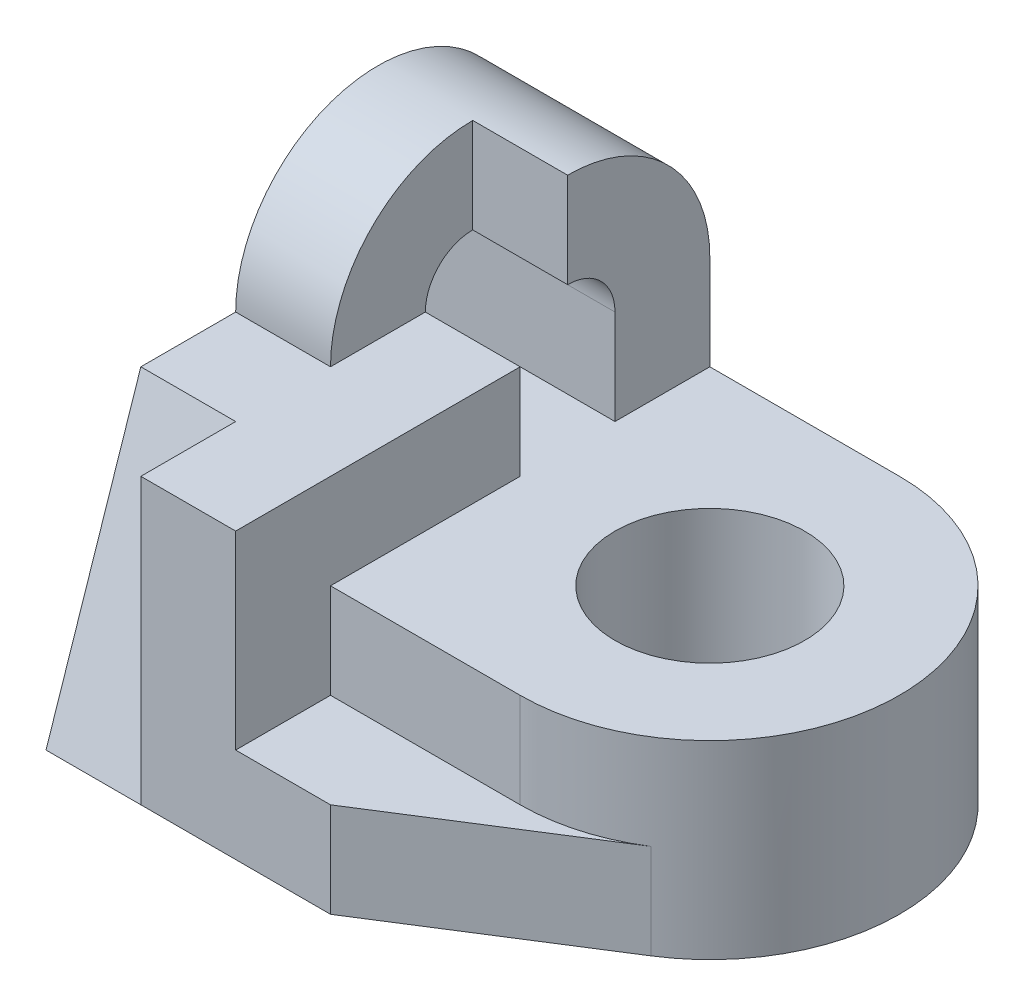
ISO-10303-21;
HEADER;
FILE_DESCRIPTION(('STEP AP214'),'2;1');
FILE_NAME('part.step','',(''),(''),'','','');
FILE_SCHEMA(('AUTOMOTIVE_DESIGN { 1 0 10303 214 1 1 1 1 }'));
ENDSEC;
DATA;
#1=APPLICATION_CONTEXT('core data for automotive mechanical design processes');
#2=APPLICATION_PROTOCOL_DEFINITION('international standard','automotive_design',2000,#1);
#3=PRODUCT_CONTEXT('',#1,'mechanical');
#4=PRODUCT('Part','Part','',(#3));
#5=PRODUCT_RELATED_PRODUCT_CATEGORY('part','',(#4));
#6=PRODUCT_DEFINITION_FORMATION('','',#4);
#7=PRODUCT_DEFINITION_CONTEXT('part definition',#1,'design');
#8=PRODUCT_DEFINITION('design','',#6,#7);
#9=PRODUCT_DEFINITION_SHAPE('','',#8);
#10=(LENGTH_UNIT() NAMED_UNIT(*) SI_UNIT(.MILLI.,.METRE.));
#11=(NAMED_UNIT(*) PLANE_ANGLE_UNIT() SI_UNIT($,.RADIAN.));
#12=(NAMED_UNIT(*) SI_UNIT($,.STERADIAN.) SOLID_ANGLE_UNIT());
#13=UNCERTAINTY_MEASURE_WITH_UNIT(LENGTH_MEASURE(1.E-05),#10,'distance_accuracy_value','');
#14=(GEOMETRIC_REPRESENTATION_CONTEXT(3) GLOBAL_UNCERTAINTY_ASSIGNED_CONTEXT((#13)) GLOBAL_UNIT_ASSIGNED_CONTEXT((#10,
#11,#12)) REPRESENTATION_CONTEXT('',''));
#15=CARTESIAN_POINT('',(0.,0.,0.));
#16=DIRECTION('',(0.,0.,1.));
#17=DIRECTION('',(1.,0.,0.));
#18=AXIS2_PLACEMENT_3D('',#15,#16,#17);
#19=CARTESIAN_POINT('',(-1.,0.,0.));
#20=DIRECTION('',(-1.,0.,0.));
#21=DIRECTION('',(0.,0.,1.));
#22=AXIS2_PLACEMENT_3D('',#19,#20,#21);
#23=PLANE('',#22);
#24=DIRECTION('',(0.,0.,1.));
#25=VECTOR('',#24,1.);
#26=CARTESIAN_POINT('',(-1.,2.,5.));
#27=LINE('',#26,#25);
#28=CARTESIAN_POINT('',(-1.,2.,4.));
#29=VERTEX_POINT('',#28);
#30=CARTESIAN_POINT('',(-1.,2.,5.));
#31=VERTEX_POINT('',#30);
#32=EDGE_CURVE('E317',#29,#31,#27,.T.);
#33=ORIENTED_EDGE('',*,*,#32,.F.);
#34=DIRECTION('',(0.,0.948683298050514,-0.316227766016838));
#35=VECTOR('',#34,1.);
#36=CARTESIAN_POINT('',(-1.,2.,4.));
#37=LINE('',#36,#35);
#38=CARTESIAN_POINT('',(-1.,-1.,5.));
#39=VERTEX_POINT('',#38);
#40=EDGE_CURVE('E48',#39,#29,#37,.T.);
#41=ORIENTED_EDGE('',*,*,#40,.F.);
#42=DIRECTION('',(0.,1.,0.));
#43=VECTOR('',#42,1.);
#44=CARTESIAN_POINT('',(-1.,-1.,5.));
#45=LINE('',#44,#43);
#46=EDGE_CURVE('E288',#39,#31,#45,.T.);
#47=ORIENTED_EDGE('',*,*,#46,.T.);
#48=EDGE_LOOP('',(#33,#41,#47));
#49=FACE_BOUND('',#48,.T.);
#50=ADVANCED_FACE('F33',(#49),#23,.T.);
#51=CARTESIAN_POINT('',(2.,1.,4.));
#52=DIRECTION('',(0.,-1.,0.));
#53=DIRECTION('',(1.,0.,0.));
#54=AXIS2_PLACEMENT_3D('',#51,#52,#53);
#55=PLANE('',#54);
#56=CARTESIAN_POINT('',(2.,1.,2.));
#57=DIRECTION('',(0.,1.,0.));
#58=DIRECTION('',(-1.,0.,0.));
#59=AXIS2_PLACEMENT_3D('',#56,#57,#58);
#60=CIRCLE('',#59,1.);
#61=CARTESIAN_POINT('',(1.,1.,2.));
#62=VERTEX_POINT('',#61);
#63=EDGE_CURVE('E196',#62,#62,#60,.T.);
#64=ORIENTED_EDGE('',*,*,#63,.F.);
#65=EDGE_LOOP('',(#64));
#66=FACE_BOUND('',#65,.T.);
#67=DIRECTION('',(0.,0.,1.));
#68=VECTOR('',#67,1.);
#69=CARTESIAN_POINT('',(0.,1.,3.));
#70=LINE('',#69,#68);
#71=CARTESIAN_POINT('',(0.,1.,2.));
#72=VERTEX_POINT('',#71);
#73=CARTESIAN_POINT('',(0.,1.,4.));
#74=VERTEX_POINT('',#73);
#75=EDGE_CURVE('E255',#72,#74,#70,.T.);
#76=ORIENTED_EDGE('',*,*,#75,.T.);
#77=DIRECTION('',(-1.,0.,0.));
#78=VECTOR('',#77,1.);
#79=CARTESIAN_POINT('',(2.,1.,4.));
#80=LINE('',#79,#78);
#81=CARTESIAN_POINT('',(2.,1.,4.));
#82=VERTEX_POINT('',#81);
#83=EDGE_CURVE('E221',#82,#74,#80,.T.);
#84=ORIENTED_EDGE('',*,*,#83,.F.);
#85=CARTESIAN_POINT('',(2.,1.,2.));
#86=DIRECTION('',(0.,1.,0.));
#87=DIRECTION('',(1.,0.,0.));
#88=AXIS2_PLACEMENT_3D('',#85,#86,#87);
#89=CIRCLE('',#88,2.);
#90=CARTESIAN_POINT('',(2.,1.,0.));
#91=VERTEX_POINT('',#90);
#92=EDGE_CURVE('E211',#82,#91,#89,.T.);
#93=ORIENTED_EDGE('',*,*,#92,.T.);
#94=DIRECTION('',(-1.,0.,0.));
#95=VECTOR('',#94,1.);
#96=CARTESIAN_POINT('',(2.,1.,0.));
#97=LINE('',#96,#95);
#98=CARTESIAN_POINT('',(0.,1.,0.));
#99=VERTEX_POINT('',#98);
#100=EDGE_CURVE('E222',#91,#99,#97,.T.);
#101=ORIENTED_EDGE('',*,*,#100,.T.);
#102=DIRECTION('',(0.,0.,1.));
#103=VECTOR('',#102,1.);
#104=CARTESIAN_POINT('',(0.,1.,1.));
#105=LINE('',#104,#103);
#106=CARTESIAN_POINT('',(0.,1.,1.));
#107=VERTEX_POINT('',#106);
#108=EDGE_CURVE('E187',#99,#107,#105,.T.);
#109=ORIENTED_EDGE('',*,*,#108,.T.);
#110=DIRECTION('',(-1.,0.,0.));
#111=VECTOR('',#110,1.);
#112=CARTESIAN_POINT('',(0.,1.,1.));
#113=LINE('',#112,#111);
#114=CARTESIAN_POINT('',(-2.,1.,1.));
#115=VERTEX_POINT('',#114);
#116=EDGE_CURVE('E205',#107,#115,#113,.T.);
#117=ORIENTED_EDGE('',*,*,#116,.T.);
#118=DIRECTION('',(0.,0.,-1.));
#119=VECTOR('',#118,1.);
#120=CARTESIAN_POINT('',(-2.,1.,4.));
#121=LINE('',#120,#119);
#122=CARTESIAN_POINT('',(-2.,1.,2.));
#123=VERTEX_POINT('',#122);
#124=EDGE_CURVE('E41',#123,#115,#121,.T.);
#125=ORIENTED_EDGE('',*,*,#124,.F.);
#126=DIRECTION('',(-1.,0.,0.));
#127=VECTOR('',#126,1.);
#128=CARTESIAN_POINT('',(0.,1.,2.));
#129=LINE('',#128,#127);
#130=EDGE_CURVE('E170',#72,#123,#129,.T.);
#131=ORIENTED_EDGE('',*,*,#130,.F.);
#132=EDGE_LOOP('',(#76,#84,#93,#101,#109,#117,#125,#131));
#133=FACE_BOUND('',#132,.T.);
#134=ADVANCED_FACE('F354',(#66,#133),#55,.F.);
#135=CARTESIAN_POINT('',(0.,0.,4.));
#136=DIRECTION('',(0.,0.,1.));
#137=DIRECTION('',(1.,0.,0.));
#138=AXIS2_PLACEMENT_3D('',#135,#136,#137);
#139=PLANE('',#138);
#140=DIRECTION('',(0.,-1.,0.));
#141=VECTOR('',#140,1.);
#142=CARTESIAN_POINT('',(0.,-1.,4.));
#143=LINE('',#142,#141);
#144=CARTESIAN_POINT('',(0.,0.,4.));
#145=VERTEX_POINT('',#144);
#146=EDGE_CURVE('E283',#74,#145,#143,.T.);
#147=ORIENTED_EDGE('',*,*,#146,.T.);
#148=DIRECTION('',(1.,0.,0.));
#149=VECTOR('',#148,1.);
#150=CARTESIAN_POINT('',(0.,0.,4.));
#151=LINE('',#150,#149);
#152=CARTESIAN_POINT('',(2.,0.,4.));
#153=VERTEX_POINT('',#152);
#154=EDGE_CURVE('E310',#145,#153,#151,.T.);
#155=ORIENTED_EDGE('',*,*,#154,.T.);
#156=DIRECTION('',(0.,1.,0.));
#157=VECTOR('',#156,1.);
#158=CARTESIAN_POINT('',(2.,-1.,4.));
#159=LINE('',#158,#157);
#160=EDGE_CURVE('E219',#153,#82,#159,.T.);
#161=ORIENTED_EDGE('',*,*,#160,.T.);
#162=ORIENTED_EDGE('',*,*,#83,.T.);
#163=EDGE_LOOP('',(#147,#155,#161,#162));
#164=FACE_BOUND('',#163,.T.);
#165=ADVANCED_FACE('F359',(#164),#139,.T.);
#166=CARTESIAN_POINT('',(2.,-1.,2.));
#167=DIRECTION('',(0.,1.,0.));
#168=DIRECTION('',(-1.,0.,0.));
#169=AXIS2_PLACEMENT_3D('',#166,#167,#168);
#170=CYLINDRICAL_SURFACE('',#169,2.);
#171=CARTESIAN_POINT('',(2.,0.,2.));
#172=DIRECTION('',(0.,1.,0.));
#173=DIRECTION('',(1.,0.,0.));
#174=AXIS2_PLACEMENT_3D('',#171,#172,#173);
#175=CIRCLE('',#174,2.);
#176=CARTESIAN_POINT('',(3.06969384566991,0.,3.68989794855664));
#177=VERTEX_POINT('',#176);
#178=EDGE_CURVE('E307',#153,#177,#175,.T.);
#179=ORIENTED_EDGE('',*,*,#178,.T.);
#180=DIRECTION('',(0.,-1.,0.));
#181=VECTOR('',#180,1.);
#182=CARTESIAN_POINT('',(3.06969384566991,0.,3.68989794855664));
#183=LINE('',#182,#181);
#184=CARTESIAN_POINT('',(3.06969384566991,-1.,3.68989794855664));
#185=VERTEX_POINT('',#184);
#186=EDGE_CURVE('E291',#177,#185,#183,.T.);
#187=ORIENTED_EDGE('',*,*,#186,.T.);
#188=CARTESIAN_POINT('',(2.,-1.,2.));
#189=DIRECTION('',(0.,1.,0.));
#190=DIRECTION('',(1.,0.,0.));
#191=AXIS2_PLACEMENT_3D('',#188,#189,#190);
#192=CIRCLE('',#191,2.);
#193=CARTESIAN_POINT('',(2.,-1.,0.));
#194=VERTEX_POINT('',#193);
#195=EDGE_CURVE('E214',#185,#194,#192,.T.);
#196=ORIENTED_EDGE('',*,*,#195,.T.);
#197=DIRECTION('',(0.,1.,0.));
#198=VECTOR('',#197,1.);
#199=CARTESIAN_POINT('',(2.,-1.,0.));
#200=LINE('',#199,#198);
#201=EDGE_CURVE('E229',#194,#91,#200,.T.);
#202=ORIENTED_EDGE('',*,*,#201,.T.);
#203=ORIENTED_EDGE('',*,*,#92,.F.);
#204=ORIENTED_EDGE('',*,*,#160,.F.);
#205=EDGE_LOOP('',(#179,#187,#196,#202,#203,#204));
#206=FACE_BOUND('',#205,.T.);
#207=ADVANCED_FACE('F334',(#206),#170,.T.);
#208=CARTESIAN_POINT('',(0.,1.,5.));
#209=DIRECTION('',(0.,0.,1.));
#210=DIRECTION('',(1.,0.,0.));
#211=AXIS2_PLACEMENT_3D('',#208,#209,#210);
#212=PLANE('',#211);
#213=DIRECTION('',(0.,1.,0.));
#214=VECTOR('',#213,1.);
#215=CARTESIAN_POINT('',(0.,1.,5.));
#216=LINE('',#215,#214);
#217=CARTESIAN_POINT('',(0.,0.,5.));
#218=VERTEX_POINT('',#217);
#219=CARTESIAN_POINT('',(0.,2.,5.));
#220=VERTEX_POINT('',#219);
#221=EDGE_CURVE('E281',#218,#220,#216,.T.);
#222=ORIENTED_EDGE('',*,*,#221,.T.);
#223=DIRECTION('',(1.,0.,0.));
#224=VECTOR('',#223,1.);
#225=CARTESIAN_POINT('',(0.,2.,5.));
#226=LINE('',#225,#224);
#227=EDGE_CURVE('E301',#31,#220,#226,.T.);
#228=ORIENTED_EDGE('',*,*,#227,.F.);
#229=ORIENTED_EDGE('',*,*,#46,.F.);
#230=DIRECTION('',(-1.,0.,0.));
#231=VECTOR('',#230,1.);
#232=CARTESIAN_POINT('',(0.,-1.,5.));
#233=LINE('',#232,#231);
#234=CARTESIAN_POINT('',(1.,-1.,5.));
#235=VERTEX_POINT('',#234);
#236=EDGE_CURVE('E270',#235,#39,#233,.T.);
#237=ORIENTED_EDGE('',*,*,#236,.F.);
#238=DIRECTION('',(0.,-1.,0.));
#239=VECTOR('',#238,1.);
#240=CARTESIAN_POINT('',(1.,0.,5.));
#241=LINE('',#240,#239);
#242=CARTESIAN_POINT('',(1.,0.,5.));
#243=VERTEX_POINT('',#242);
#244=EDGE_CURVE('E290',#243,#235,#241,.T.);
#245=ORIENTED_EDGE('',*,*,#244,.F.);
#246=DIRECTION('',(-1.,0.,0.));
#247=VECTOR('',#246,1.);
#248=CARTESIAN_POINT('',(0.,0.,5.));
#249=LINE('',#248,#247);
#250=EDGE_CURVE('E294',#243,#218,#249,.T.);
#251=ORIENTED_EDGE('',*,*,#250,.T.);
#252=EDGE_LOOP('',(#222,#228,#229,#237,#245,#251));
#253=FACE_BOUND('',#252,.T.);
#254=ADVANCED_FACE('F345',(#253),#212,.T.);
#255=CARTESIAN_POINT('',(0.,2.,1.5));
#256=DIRECTION('',(1.,0.,0.));
#257=DIRECTION('',(0.,0.,-1.));
#258=AXIS2_PLACEMENT_3D('',#255,#256,#257);
#259=PLANE('',#258);
#260=DIRECTION('',(0.,0.,-1.));
#261=VECTOR('',#260,1.);
#262=CARTESIAN_POINT('',(0.,2.,2.));
#263=LINE('',#262,#261);
#264=CARTESIAN_POINT('',(0.,2.,2.));
#265=VERTEX_POINT('',#264);
#266=EDGE_CURVE('E265',#220,#265,#263,.T.);
#267=ORIENTED_EDGE('',*,*,#266,.F.);
#268=ORIENTED_EDGE('',*,*,#221,.F.);
#269=DIRECTION('',(0.,0.,-1.));
#270=VECTOR('',#269,1.);
#271=CARTESIAN_POINT('',(0.,0.,5.));
#272=LINE('',#271,#270);
#273=EDGE_CURVE('E300',#218,#145,#272,.T.);
#274=ORIENTED_EDGE('',*,*,#273,.T.);
#275=ORIENTED_EDGE('',*,*,#146,.F.);
#276=ORIENTED_EDGE('',*,*,#75,.F.);
#277=DIRECTION('',(0.,-1.,0.));
#278=VECTOR('',#277,1.);
#279=CARTESIAN_POINT('',(0.,1.,2.));
#280=LINE('',#279,#278);
#281=EDGE_CURVE('E257',#265,#72,#280,.T.);
#282=ORIENTED_EDGE('',*,*,#281,.F.);
#283=EDGE_LOOP('',(#267,#268,#274,#275,#276,#282));
#284=FACE_BOUND('',#283,.T.);
#285=ADVANCED_FACE('F349',(#284),#259,.T.);
#286=CARTESIAN_POINT('',(-2.,-1.,4.));
#287=DIRECTION('',(1.,0.,0.));
#288=DIRECTION('',(0.,0.,-1.));
#289=AXIS2_PLACEMENT_3D('',#286,#287,#288);
#290=PLANE('',#289);
#291=DIRECTION('',(0.,0.,-1.));
#292=VECTOR('',#291,1.);
#293=CARTESIAN_POINT('',(-2.,-1.,4.));
#294=LINE('',#293,#292);
#295=CARTESIAN_POINT('',(-2.,-1.,5.));
#296=VERTEX_POINT('',#295);
#297=CARTESIAN_POINT('',(-2.,-1.,0.));
#298=VERTEX_POINT('',#297);
#299=EDGE_CURVE('E11',#296,#298,#294,.T.);
#300=ORIENTED_EDGE('',*,*,#299,.F.);
#301=DIRECTION('',(0.,0.948683298050514,-0.316227766016838));
#302=VECTOR('',#301,1.);
#303=CARTESIAN_POINT('',(-2.,2.,4.));
#304=LINE('',#303,#302);
#305=CARTESIAN_POINT('',(-2.,2.,4.));
#306=VERTEX_POINT('',#305);
#307=EDGE_CURVE('E179',#296,#306,#304,.T.);
#308=ORIENTED_EDGE('',*,*,#307,.T.);
#309=DIRECTION('',(0.,0.,1.));
#310=VECTOR('',#309,1.);
#311=CARTESIAN_POINT('',(-2.,2.,4.));
#312=LINE('',#311,#310);
#313=CARTESIAN_POINT('',(-2.,2.,3.));
#314=VERTEX_POINT('',#313);
#315=EDGE_CURVE('E162',#314,#306,#312,.T.);
#316=ORIENTED_EDGE('',*,*,#315,.F.);
#317=CARTESIAN_POINT('',(-2.,2.,1.5));
#318=DIRECTION('',(-1.,0.,0.));
#319=DIRECTION('',(0.,0.,-1.));
#320=AXIS2_PLACEMENT_3D('',#317,#318,#319);
#321=CIRCLE('',#320,1.5);
#322=CARTESIAN_POINT('',(-2.,2.,0.));
#323=VERTEX_POINT('',#322);
#324=EDGE_CURVE('E177',#314,#323,#321,.T.);
#325=ORIENTED_EDGE('',*,*,#324,.T.);
#326=DIRECTION('',(0.,-1.,0.));
#327=VECTOR('',#326,1.);
#328=CARTESIAN_POINT('',(-2.,-1.,0.));
#329=LINE('',#328,#327);
#330=EDGE_CURVE('E216',#323,#298,#329,.T.);
#331=ORIENTED_EDGE('',*,*,#330,.T.);
#332=EDGE_LOOP('',(#300,#308,#316,#325,#331));
#333=FACE_BOUND('',#332,.T.);
#334=ORIENTED_EDGE('',*,*,#124,.T.);
#335=DIRECTION('',(0.,1.,0.));
#336=VECTOR('',#335,1.);
#337=CARTESIAN_POINT('',(-2.,1.,1.));
#338=LINE('',#337,#336);
#339=CARTESIAN_POINT('',(-2.,2.,1.));
#340=VERTEX_POINT('',#339);
#341=EDGE_CURVE('E237',#115,#340,#338,.T.);
#342=ORIENTED_EDGE('',*,*,#341,.T.);
#343=CARTESIAN_POINT('',(-2.,2.,1.5));
#344=DIRECTION('',(1.,0.,0.));
#345=DIRECTION('',(0.,0.,-1.));
#346=AXIS2_PLACEMENT_3D('',#343,#344,#345);
#347=CIRCLE('',#346,0.5);
#348=CARTESIAN_POINT('',(-2.,2.,2.));
#349=VERTEX_POINT('',#348);
#350=EDGE_CURVE('E192',#340,#349,#347,.T.);
#351=ORIENTED_EDGE('',*,*,#350,.T.);
#352=DIRECTION('',(0.,-1.,0.));
#353=VECTOR('',#352,1.);
#354=CARTESIAN_POINT('',(-2.,1.,2.));
#355=LINE('',#354,#353);
#356=EDGE_CURVE('E188',#349,#123,#355,.T.);
#357=ORIENTED_EDGE('',*,*,#356,.T.);
#358=EDGE_LOOP('',(#334,#342,#351,#357));
#359=FACE_BOUND('',#358,.T.);
#360=ADVANCED_FACE('F35',(#333,#359),#290,.F.);
#361=CARTESIAN_POINT('',(2.,-1.,4.));
#362=DIRECTION('',(0.,1.,0.));
#363=DIRECTION('',(-1.,0.,0.));
#364=AXIS2_PLACEMENT_3D('',#361,#362,#363);
#365=PLANE('',#364);
#366=ORIENTED_EDGE('',*,*,#195,.F.);
#367=DIRECTION('',(-0.844948974278318,0.,0.534846922834954));
#368=VECTOR('',#367,1.);
#369=CARTESIAN_POINT('',(1.,-1.,5.));
#370=LINE('',#369,#368);
#371=EDGE_CURVE('E297',#185,#235,#370,.T.);
#372=ORIENTED_EDGE('',*,*,#371,.T.);
#373=ORIENTED_EDGE('',*,*,#236,.T.);
#374=DIRECTION('',(-1.,0.,0.));
#375=VECTOR('',#374,1.);
#376=CARTESIAN_POINT('',(-1.,-1.,5.));
#377=LINE('',#376,#375);
#378=EDGE_CURVE('E286',#39,#296,#377,.T.);
#379=ORIENTED_EDGE('',*,*,#378,.T.);
#380=ORIENTED_EDGE('',*,*,#299,.T.);
#381=DIRECTION('',(1.,0.,0.));
#382=VECTOR('',#381,1.);
#383=CARTESIAN_POINT('',(2.,-1.,0.));
#384=LINE('',#383,#382);
#385=EDGE_CURVE('E226',#298,#194,#384,.T.);
#386=ORIENTED_EDGE('',*,*,#385,.T.);
#387=EDGE_LOOP('',(#366,#372,#373,#379,#380,#386));
#388=FACE_BOUND('',#387,.T.);
#389=CARTESIAN_POINT('',(2.,-1.,2.));
#390=DIRECTION('',(0.,1.,0.));
#391=DIRECTION('',(-1.,0.,0.));
#392=AXIS2_PLACEMENT_3D('',#389,#390,#391);
#393=CIRCLE('',#392,1.);
#394=CARTESIAN_POINT('',(1.,-1.,2.));
#395=VERTEX_POINT('',#394);
#396=EDGE_CURVE('E208',#395,#395,#393,.T.);
#397=ORIENTED_EDGE('',*,*,#396,.T.);
#398=EDGE_LOOP('',(#397));
#399=FACE_BOUND('',#398,.T.);
#400=ADVANCED_FACE('F327',(#388,#399),#365,.F.);
#401=CARTESIAN_POINT('',(0.,0.,0.));
#402=DIRECTION('',(0.,0.,1.));
#403=DIRECTION('',(1.,0.,0.));
#404=AXIS2_PLACEMENT_3D('',#401,#402,#403);
#405=PLANE('',#404);
#406=ORIENTED_EDGE('',*,*,#330,.F.);
#407=DIRECTION('',(-1.,0.,0.));
#408=VECTOR('',#407,1.);
#409=CARTESIAN_POINT('',(0.,2.,0.));
#410=LINE('',#409,#408);
#411=CARTESIAN_POINT('',(0.,2.,0.));
#412=VERTEX_POINT('',#411);
#413=EDGE_CURVE('E169',#412,#323,#410,.T.);
#414=ORIENTED_EDGE('',*,*,#413,.F.);
#415=DIRECTION('',(0.,-1.,0.));
#416=VECTOR('',#415,1.);
#417=CARTESIAN_POINT('',(0.,1.,0.));
#418=LINE('',#417,#416);
#419=EDGE_CURVE('E207',#412,#99,#418,.T.);
#420=ORIENTED_EDGE('',*,*,#419,.T.);
#421=ORIENTED_EDGE('',*,*,#100,.F.);
#422=ORIENTED_EDGE('',*,*,#201,.F.);
#423=ORIENTED_EDGE('',*,*,#385,.F.);
#424=EDGE_LOOP('',(#406,#414,#420,#421,#422,#423));
#425=FACE_BOUND('',#424,.T.);
#426=ADVANCED_FACE('F330',(#425),#405,.F.);
#427=CARTESIAN_POINT('',(2.,-1.,2.));
#428=DIRECTION('',(0.,1.,0.));
#429=DIRECTION('',(-1.,0.,0.));
#430=AXIS2_PLACEMENT_3D('',#427,#428,#429);
#431=CYLINDRICAL_SURFACE('',#430,1.);
#432=ORIENTED_EDGE('',*,*,#396,.F.);
#433=EDGE_LOOP('',(#432));
#434=FACE_BOUND('',#433,.T.);
#435=ORIENTED_EDGE('',*,*,#63,.T.);
#436=EDGE_LOOP('',(#435));
#437=FACE_BOUND('',#436,.T.);
#438=ADVANCED_FACE('F383',(#434,#437),#431,.F.);
#439=CARTESIAN_POINT('',(0.,2.,1.5));
#440=DIRECTION('',(-1.,0.,0.));
#441=DIRECTION('',(0.,0.,1.));
#442=AXIS2_PLACEMENT_3D('',#439,#440,#441);
#443=CYLINDRICAL_SURFACE('',#442,1.5);
#444=DIRECTION('',(1.,0.,0.));
#445=VECTOR('',#444,1.);
#446=CARTESIAN_POINT('',(-1.,3.5,1.5));
#447=LINE('',#446,#445);
#448=CARTESIAN_POINT('',(-1.,3.5,1.5));
#449=VERTEX_POINT('',#448);
#450=CARTESIAN_POINT('',(0.,3.5,1.5));
#451=VERTEX_POINT('',#450);
#452=EDGE_CURVE('E247',#449,#451,#447,.T.);
#453=ORIENTED_EDGE('',*,*,#452,.T.);
#454=CARTESIAN_POINT('',(0.,2.,1.5));
#455=DIRECTION('',(-1.,0.,0.));
#456=DIRECTION('',(0.,0.,-1.));
#457=AXIS2_PLACEMENT_3D('',#454,#455,#456);
#458=CIRCLE('',#457,1.5);
#459=EDGE_CURVE('E253',#451,#412,#458,.T.);
#460=ORIENTED_EDGE('',*,*,#459,.T.);
#461=ORIENTED_EDGE('',*,*,#413,.T.);
#462=ORIENTED_EDGE('',*,*,#324,.F.);
#463=DIRECTION('',(-1.,0.,0.));
#464=VECTOR('',#463,1.);
#465=CARTESIAN_POINT('',(0.,2.,3.));
#466=LINE('',#465,#464);
#467=CARTESIAN_POINT('',(-1.,2.,3.));
#468=VERTEX_POINT('',#467);
#469=EDGE_CURVE('E159',#468,#314,#466,.T.);
#470=ORIENTED_EDGE('',*,*,#469,.F.);
#471=CARTESIAN_POINT('',(-1.,2.,1.5));
#472=DIRECTION('',(1.,0.,0.));
#473=DIRECTION('',(0.,0.,1.));
#474=AXIS2_PLACEMENT_3D('',#471,#472,#473);
#475=CIRCLE('',#474,1.5);
#476=EDGE_CURVE('E272',#449,#468,#475,.T.);
#477=ORIENTED_EDGE('',*,*,#476,.F.);
#478=EDGE_LOOP('',(#453,#460,#461,#462,#470,#477));
#479=FACE_BOUND('',#478,.T.);
#480=ADVANCED_FACE('F185',(#479),#443,.T.);
#481=CARTESIAN_POINT('',(0.,1.,2.));
#482=DIRECTION('',(0.,0.,-1.));
#483=DIRECTION('',(-1.,0.,0.));
#484=AXIS2_PLACEMENT_3D('',#481,#482,#483);
#485=PLANE('',#484);
#486=ORIENTED_EDGE('',*,*,#356,.F.);
#487=DIRECTION('',(-1.,0.,0.));
#488=VECTOR('',#487,1.);
#489=CARTESIAN_POINT('',(0.,2.,2.));
#490=LINE('',#489,#488);
#491=CARTESIAN_POINT('',(-1.,2.,2.));
#492=VERTEX_POINT('',#491);
#493=EDGE_CURVE('E202',#492,#349,#490,.T.);
#494=ORIENTED_EDGE('',*,*,#493,.F.);
#495=EDGE_CURVE('E200',#265,#492,#490,.T.);
#496=ORIENTED_EDGE('',*,*,#495,.F.);
#497=ORIENTED_EDGE('',*,*,#281,.T.);
#498=ORIENTED_EDGE('',*,*,#130,.T.);
#499=EDGE_LOOP('',(#486,#494,#496,#497,#498));
#500=FACE_BOUND('',#499,.T.);
#501=ADVANCED_FACE('F382',(#500),#485,.T.);
#502=CARTESIAN_POINT('',(0.,2.,1.5));
#503=DIRECTION('',(-1.,0.,0.));
#504=DIRECTION('',(0.,0.,1.));
#505=AXIS2_PLACEMENT_3D('',#502,#503,#504);
#506=CYLINDRICAL_SURFACE('',#505,0.5);
#507=DIRECTION('',(1.,0.,0.));
#508=VECTOR('',#507,1.);
#509=CARTESIAN_POINT('',(-1.,2.5,1.5));
#510=LINE('',#509,#508);
#511=CARTESIAN_POINT('',(-1.,2.5,1.5));
#512=VERTEX_POINT('',#511);
#513=CARTESIAN_POINT('',(0.,2.5,1.5));
#514=VERTEX_POINT('',#513);
#515=EDGE_CURVE('E56',#512,#514,#510,.T.);
#516=ORIENTED_EDGE('',*,*,#515,.F.);
#517=CARTESIAN_POINT('',(-1.,2.,1.5));
#518=DIRECTION('',(-1.,0.,0.));
#519=DIRECTION('',(0.,0.,-1.));
#520=AXIS2_PLACEMENT_3D('',#517,#518,#519);
#521=CIRCLE('',#520,0.5);
#522=EDGE_CURVE('E267',#492,#512,#521,.T.);
#523=ORIENTED_EDGE('',*,*,#522,.F.);
#524=ORIENTED_EDGE('',*,*,#493,.T.);
#525=ORIENTED_EDGE('',*,*,#350,.F.);
#526=DIRECTION('',(-1.,0.,0.));
#527=VECTOR('',#526,1.);
#528=CARTESIAN_POINT('',(0.,2.,1.));
#529=LINE('',#528,#527);
#530=CARTESIAN_POINT('',(0.,2.,1.));
#531=VERTEX_POINT('',#530);
#532=EDGE_CURVE('E203',#531,#340,#529,.T.);
#533=ORIENTED_EDGE('',*,*,#532,.F.);
#534=CARTESIAN_POINT('',(0.,2.,1.5));
#535=DIRECTION('',(1.,0.,0.));
#536=DIRECTION('',(0.,0.,-1.));
#537=AXIS2_PLACEMENT_3D('',#534,#535,#536);
#538=CIRCLE('',#537,0.5);
#539=EDGE_CURVE('E260',#531,#514,#538,.T.);
#540=ORIENTED_EDGE('',*,*,#539,.T.);
#541=EDGE_LOOP('',(#516,#523,#524,#525,#533,#540));
#542=FACE_BOUND('',#541,.T.);
#543=ADVANCED_FACE('F386',(#542),#506,.F.);
#544=CARTESIAN_POINT('',(0.,1.,1.));
#545=DIRECTION('',(0.,0.,1.));
#546=DIRECTION('',(1.,0.,0.));
#547=AXIS2_PLACEMENT_3D('',#544,#545,#546);
#548=PLANE('',#547);
#549=ORIENTED_EDGE('',*,*,#341,.F.);
#550=ORIENTED_EDGE('',*,*,#116,.F.);
#551=DIRECTION('',(0.,1.,0.));
#552=VECTOR('',#551,1.);
#553=CARTESIAN_POINT('',(0.,1.,1.));
#554=LINE('',#553,#552);
#555=EDGE_CURVE('E190',#107,#531,#554,.T.);
#556=ORIENTED_EDGE('',*,*,#555,.T.);
#557=ORIENTED_EDGE('',*,*,#532,.T.);
#558=EDGE_LOOP('',(#549,#550,#556,#557));
#559=FACE_BOUND('',#558,.T.);
#560=ADVANCED_FACE('F243',(#559),#548,.T.);
#561=DIRECTION('',(0.,1.,0.));
#562=VECTOR('',#561,1.);
#563=CARTESIAN_POINT('',(0.,2.5,1.5));
#564=LINE('',#563,#562);
#565=EDGE_CURVE('E268',#514,#451,#564,.T.);
#566=ORIENTED_EDGE('',*,*,#565,.F.);
#567=ORIENTED_EDGE('',*,*,#539,.F.);
#568=ORIENTED_EDGE('',*,*,#555,.F.);
#569=ORIENTED_EDGE('',*,*,#108,.F.);
#570=ORIENTED_EDGE('',*,*,#419,.F.);
#571=ORIENTED_EDGE('',*,*,#459,.F.);
#572=EDGE_LOOP('',(#566,#567,#568,#569,#570,#571));
#573=FACE_BOUND('',#572,.T.);
#574=ADVANCED_FACE('F374',(#573),#259,.T.);
#575=CARTESIAN_POINT('',(-1.,2.,2.));
#576=DIRECTION('',(0.,-1.,0.));
#577=DIRECTION('',(0.,0.,-1.));
#578=AXIS2_PLACEMENT_3D('',#575,#576,#577);
#579=PLANE('',#578);
#580=ORIENTED_EDGE('',*,*,#266,.T.);
#581=ORIENTED_EDGE('',*,*,#495,.T.);
#582=DIRECTION('',(0.,0.,-1.));
#583=VECTOR('',#582,1.);
#584=CARTESIAN_POINT('',(-1.,2.,2.));
#585=LINE('',#584,#583);
#586=EDGE_CURVE('E165',#468,#492,#585,.T.);
#587=ORIENTED_EDGE('',*,*,#586,.F.);
#588=ORIENTED_EDGE('',*,*,#469,.T.);
#589=ORIENTED_EDGE('',*,*,#315,.T.);
#590=DIRECTION('',(1.,0.,0.));
#591=VECTOR('',#590,1.);
#592=CARTESIAN_POINT('',(-1.,2.,4.));
#593=LINE('',#592,#591);
#594=EDGE_CURVE('E181',#306,#29,#593,.T.);
#595=ORIENTED_EDGE('',*,*,#594,.T.);
#596=ORIENTED_EDGE('',*,*,#32,.T.);
#597=ORIENTED_EDGE('',*,*,#227,.T.);
#598=EDGE_LOOP('',(#580,#581,#587,#588,#589,#595,#596,#597));
#599=FACE_BOUND('',#598,.T.);
#600=ADVANCED_FACE('F161',(#599),#579,.F.);
#601=CARTESIAN_POINT('',(-1.,2.5,1.5));
#602=DIRECTION('',(0.,0.,-1.));
#603=DIRECTION('',(-1.,0.,0.));
#604=AXIS2_PLACEMENT_3D('',#601,#602,#603);
#605=PLANE('',#604);
#606=ORIENTED_EDGE('',*,*,#565,.T.);
#607=ORIENTED_EDGE('',*,*,#452,.F.);
#608=DIRECTION('',(0.,1.,0.));
#609=VECTOR('',#608,1.);
#610=CARTESIAN_POINT('',(-1.,2.5,1.5));
#611=LINE('',#610,#609);
#612=EDGE_CURVE('E274',#512,#449,#611,.T.);
#613=ORIENTED_EDGE('',*,*,#612,.F.);
#614=ORIENTED_EDGE('',*,*,#515,.T.);
#615=EDGE_LOOP('',(#606,#607,#613,#614));
#616=FACE_BOUND('',#615,.T.);
#617=ADVANCED_FACE('F370',(#616),#605,.F.);
#618=CARTESIAN_POINT('',(-1.,2.,1.5));
#619=DIRECTION('',(1.,0.,0.));
#620=DIRECTION('',(0.,0.,-1.));
#621=AXIS2_PLACEMENT_3D('',#618,#619,#620);
#622=PLANE('',#621);
#623=ORIENTED_EDGE('',*,*,#522,.T.);
#624=ORIENTED_EDGE('',*,*,#612,.T.);
#625=ORIENTED_EDGE('',*,*,#476,.T.);
#626=ORIENTED_EDGE('',*,*,#586,.T.);
#627=EDGE_LOOP('',(#623,#624,#625,#626));
#628=FACE_BOUND('',#627,.T.);
#629=ADVANCED_FACE('F367',(#628),#622,.T.);
#630=CARTESIAN_POINT('',(1.,0.,5.));
#631=DIRECTION('',(0.534846922834954,0.,0.844948974278318));
#632=DIRECTION('',(0.844948974278318,0.,-0.534846922834954));
#633=AXIS2_PLACEMENT_3D('',#630,#631,#632);
#634=PLANE('',#633);
#635=ORIENTED_EDGE('',*,*,#371,.F.);
#636=ORIENTED_EDGE('',*,*,#186,.F.);
#637=DIRECTION('',(-0.844948974278318,0.,0.534846922834954));
#638=VECTOR('',#637,1.);
#639=CARTESIAN_POINT('',(1.,0.,5.));
#640=LINE('',#639,#638);
#641=EDGE_CURVE('E304',#177,#243,#640,.T.);
#642=ORIENTED_EDGE('',*,*,#641,.T.);
#643=ORIENTED_EDGE('',*,*,#244,.T.);
#644=EDGE_LOOP('',(#635,#636,#642,#643));
#645=FACE_BOUND('',#644,.T.);
#646=ADVANCED_FACE('F339',(#645),#634,.T.);
#647=CARTESIAN_POINT('',(2.,0.,2.));
#648=DIRECTION('',(0.,-1.,0.));
#649=DIRECTION('',(1.,0.,0.));
#650=AXIS2_PLACEMENT_3D('',#647,#648,#649);
#651=PLANE('',#650);
#652=ORIENTED_EDGE('',*,*,#273,.F.);
#653=ORIENTED_EDGE('',*,*,#250,.F.);
#654=ORIENTED_EDGE('',*,*,#641,.F.);
#655=ORIENTED_EDGE('',*,*,#178,.F.);
#656=ORIENTED_EDGE('',*,*,#154,.F.);
#657=EDGE_LOOP('',(#652,#653,#654,#655,#656));
#658=FACE_BOUND('',#657,.T.);
#659=ADVANCED_FACE('F342',(#658),#651,.F.);
#660=CARTESIAN_POINT('',(-2.,2.,4.));
#661=DIRECTION('',(0.,-0.316227766016838,-0.948683298050514));
#662=DIRECTION('',(0.,0.948683298050514,-0.316227766016838));
#663=AXIS2_PLACEMENT_3D('',#660,#661,#662);
#664=PLANE('',#663);
#665=ORIENTED_EDGE('',*,*,#40,.T.);
#666=ORIENTED_EDGE('',*,*,#594,.F.);
#667=ORIENTED_EDGE('',*,*,#307,.F.);
#668=ORIENTED_EDGE('',*,*,#378,.F.);
#669=EDGE_LOOP('',(#665,#666,#667,#668));
#670=FACE_BOUND('',#669,.T.);
#671=ADVANCED_FACE('F324',(#670),#664,.F.);
#672=CLOSED_SHELL('',(#50,#134,#165,#207,#254,#285,#360,#400,#426,#438,#480,#501,#543,#560,#574,
#600,#617,#629,#646,#659,#671));
#673=MANIFOLD_SOLID_BREP('B2',#672);
#674=ADVANCED_BREP_SHAPE_REPRESENTATION('',(#18,#673),#14);
#675=SHAPE_DEFINITION_REPRESENTATION(#9,#674);
ENDSEC;
END-ISO-10303-21;
